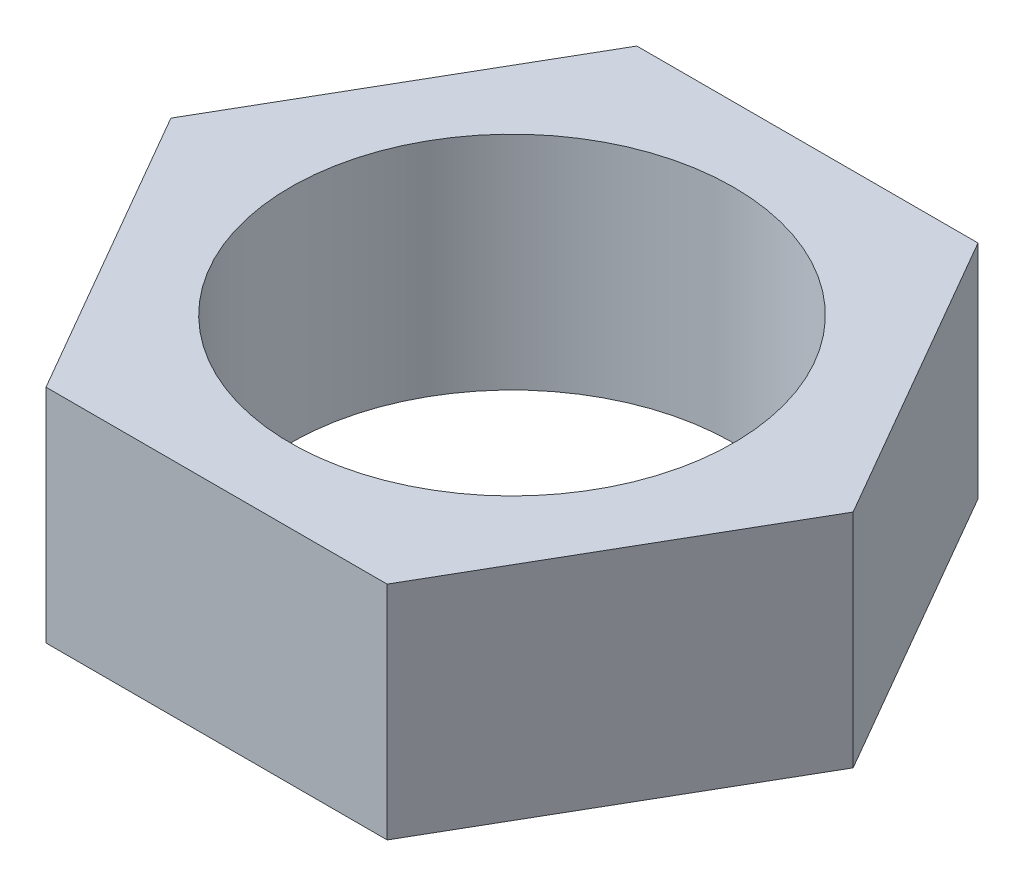
ISO-10303-21;
HEADER;
FILE_DESCRIPTION(('STEP AP214'),'2;1');
FILE_NAME('part.step','',(''),(''),'','','');
FILE_SCHEMA(('AUTOMOTIVE_DESIGN { 1 0 10303 214 1 1 1 1 }'));
ENDSEC;
DATA;
#1=APPLICATION_CONTEXT('core data for automotive mechanical design processes');
#2=APPLICATION_PROTOCOL_DEFINITION('international standard','automotive_design',2000,#1);
#3=PRODUCT_CONTEXT('',#1,'mechanical');
#4=PRODUCT('Part','Part','',(#3));
#5=PRODUCT_RELATED_PRODUCT_CATEGORY('part','',(#4));
#6=PRODUCT_DEFINITION_FORMATION('','',#4);
#7=PRODUCT_DEFINITION_CONTEXT('part definition',#1,'design');
#8=PRODUCT_DEFINITION('design','',#6,#7);
#9=PRODUCT_DEFINITION_SHAPE('','',#8);
#10=(LENGTH_UNIT() NAMED_UNIT(*) SI_UNIT(.MILLI.,.METRE.));
#11=(NAMED_UNIT(*) PLANE_ANGLE_UNIT() SI_UNIT($,.RADIAN.));
#12=(NAMED_UNIT(*) SI_UNIT($,.STERADIAN.) SOLID_ANGLE_UNIT());
#13=UNCERTAINTY_MEASURE_WITH_UNIT(LENGTH_MEASURE(1.E-05),#10,'distance_accuracy_value','');
#14=(GEOMETRIC_REPRESENTATION_CONTEXT(3) GLOBAL_UNCERTAINTY_ASSIGNED_CONTEXT((#13)) GLOBAL_UNIT_ASSIGNED_CONTEXT((#10,
#11,#12)) REPRESENTATION_CONTEXT('',''));
#15=CARTESIAN_POINT('',(0.,0.,0.));
#16=DIRECTION('',(0.,0.,1.));
#17=DIRECTION('',(1.,0.,0.));
#18=AXIS2_PLACEMENT_3D('',#15,#16,#17);
#19=CARTESIAN_POINT('',(2.30940107675854,3.,3.99999999999996));
#20=DIRECTION('',(-0.866025403784441,0.,-0.499999999999995));
#21=DIRECTION('',(-0.499999999999995,0.,0.866025403784442));
#22=AXIS2_PLACEMENT_3D('',#19,#20,#21);
#23=PLANE('',#22);
#24=DIRECTION('',(0.499999999999995,0.,-0.866025403784442));
#25=VECTOR('',#24,1.);
#26=CARTESIAN_POINT('',(2.30940107675854,0.,3.99999999999996));
#27=LINE('',#26,#25);
#28=CARTESIAN_POINT('',(2.30940107675854,0.,3.99999999999996));
#29=VERTEX_POINT('',#28);
#30=CARTESIAN_POINT('',(4.61880215351699,0.,0.));
#31=VERTEX_POINT('',#30);
#32=EDGE_CURVE('E128',#29,#31,#27,.T.);
#33=ORIENTED_EDGE('',*,*,#32,.T.);
#34=DIRECTION('',(0.,-1.,0.));
#35=VECTOR('',#34,1.);
#36=CARTESIAN_POINT('',(4.61880215351699,3.,0.));
#37=LINE('',#36,#35);
#38=CARTESIAN_POINT('',(4.61880215351699,3.,0.));
#39=VERTEX_POINT('',#38);
#40=EDGE_CURVE('E11',#39,#31,#37,.T.);
#41=ORIENTED_EDGE('',*,*,#40,.F.);
#42=DIRECTION('',(0.499999999999995,0.,-0.866025403784442));
#43=VECTOR('',#42,1.);
#44=CARTESIAN_POINT('',(2.30940107675854,3.,3.99999999999996));
#45=LINE('',#44,#43);
#46=CARTESIAN_POINT('',(2.30940107675854,3.,3.99999999999996));
#47=VERTEX_POINT('',#46);
#48=EDGE_CURVE('E145',#47,#39,#45,.T.);
#49=ORIENTED_EDGE('',*,*,#48,.F.);
#50=DIRECTION('',(0.,-1.,0.));
#51=VECTOR('',#50,1.);
#52=CARTESIAN_POINT('',(2.30940107675854,3.,3.99999999999996));
#53=LINE('',#52,#51);
#54=EDGE_CURVE('E124',#47,#29,#53,.T.);
#55=ORIENTED_EDGE('',*,*,#54,.T.);
#56=EDGE_LOOP('',(#33,#41,#49,#55));
#57=FACE_BOUND('',#56,.T.);
#58=ADVANCED_FACE('F39',(#57),#23,.F.);
#59=CARTESIAN_POINT('',(4.61880215351699,3.,0.));
#60=DIRECTION('',(-0.866025403784438,0.,0.500000000000001));
#61=DIRECTION('',(0.500000000000001,0.,0.866025403784438));
#62=AXIS2_PLACEMENT_3D('',#59,#60,#61);
#63=PLANE('',#62);
#64=DIRECTION('',(-0.500000000000001,0.,-0.866025403784438));
#65=VECTOR('',#64,1.);
#66=CARTESIAN_POINT('',(4.61880215351699,0.,0.));
#67=LINE('',#66,#65);
#68=CARTESIAN_POINT('',(2.30940107675849,0.,-3.99999999999999));
#69=VERTEX_POINT('',#68);
#70=EDGE_CURVE('E132',#31,#69,#67,.T.);
#71=ORIENTED_EDGE('',*,*,#70,.T.);
#72=DIRECTION('',(0.,-1.,0.));
#73=VECTOR('',#72,1.);
#74=CARTESIAN_POINT('',(2.30940107675849,3.,-3.99999999999999));
#75=LINE('',#74,#73);
#76=CARTESIAN_POINT('',(2.30940107675849,3.,-3.99999999999999));
#77=VERTEX_POINT('',#76);
#78=EDGE_CURVE('E48',#77,#69,#75,.T.);
#79=ORIENTED_EDGE('',*,*,#78,.F.);
#80=DIRECTION('',(-0.500000000000001,0.,-0.866025403784438));
#81=VECTOR('',#80,1.);
#82=CARTESIAN_POINT('',(4.61880215351699,3.,0.));
#83=LINE('',#82,#81);
#84=EDGE_CURVE('E93',#39,#77,#83,.T.);
#85=ORIENTED_EDGE('',*,*,#84,.F.);
#86=ORIENTED_EDGE('',*,*,#40,.T.);
#87=EDGE_LOOP('',(#71,#79,#85,#86));
#88=FACE_BOUND('',#87,.T.);
#89=ADVANCED_FACE('F174',(#88),#63,.F.);
#90=CARTESIAN_POINT('',(2.30940107675849,3.,-3.99999999999999));
#91=DIRECTION('',(0.,0.,1.));
#92=DIRECTION('',(1.,0.,0.));
#93=AXIS2_PLACEMENT_3D('',#90,#91,#92);
#94=PLANE('',#93);
#95=DIRECTION('',(-1.,0.,0.));
#96=VECTOR('',#95,1.);
#97=CARTESIAN_POINT('',(2.30940107675849,0.,-3.99999999999999));
#98=LINE('',#97,#96);
#99=CARTESIAN_POINT('',(-2.30940107675851,0.,-3.99999999999998));
#100=VERTEX_POINT('',#99);
#101=EDGE_CURVE('E136',#69,#100,#98,.T.);
#102=ORIENTED_EDGE('',*,*,#101,.T.);
#103=DIRECTION('',(0.,-1.,0.));
#104=VECTOR('',#103,1.);
#105=CARTESIAN_POINT('',(-2.30940107675851,3.,-3.99999999999998));
#106=LINE('',#105,#104);
#107=CARTESIAN_POINT('',(-2.30940107675851,3.,-3.99999999999998));
#108=VERTEX_POINT('',#107);
#109=EDGE_CURVE('E117',#108,#100,#106,.T.);
#110=ORIENTED_EDGE('',*,*,#109,.F.);
#111=DIRECTION('',(-1.,0.,0.));
#112=VECTOR('',#111,1.);
#113=CARTESIAN_POINT('',(2.30940107675849,3.,-3.99999999999999));
#114=LINE('',#113,#112);
#115=EDGE_CURVE('E106',#77,#108,#114,.T.);
#116=ORIENTED_EDGE('',*,*,#115,.F.);
#117=ORIENTED_EDGE('',*,*,#78,.T.);
#118=EDGE_LOOP('',(#102,#110,#116,#117));
#119=FACE_BOUND('',#118,.T.);
#120=ADVANCED_FACE('F155',(#119),#94,.F.);
#121=CARTESIAN_POINT('',(-2.30940107675851,3.,-3.99999999999998));
#122=DIRECTION('',(0.866025403784441,0.,0.499999999999995));
#123=DIRECTION('',(0.499999999999995,0.,-0.866025403784442));
#124=AXIS2_PLACEMENT_3D('',#121,#122,#123);
#125=PLANE('',#124);
#126=DIRECTION('',(-0.499999999999995,0.,0.866025403784442));
#127=VECTOR('',#126,1.);
#128=CARTESIAN_POINT('',(-2.30940107675851,0.,-3.99999999999998));
#129=LINE('',#128,#127);
#130=CARTESIAN_POINT('',(-4.61880215351699,0.,0.));
#131=VERTEX_POINT('',#130);
#132=EDGE_CURVE('E115',#100,#131,#129,.T.);
#133=ORIENTED_EDGE('',*,*,#132,.T.);
#134=DIRECTION('',(0.,-1.,0.));
#135=VECTOR('',#134,1.);
#136=CARTESIAN_POINT('',(-4.61880215351699,3.,0.));
#137=LINE('',#136,#135);
#138=CARTESIAN_POINT('',(-4.61880215351699,3.,0.));
#139=VERTEX_POINT('',#138);
#140=EDGE_CURVE('E112',#139,#131,#137,.T.);
#141=ORIENTED_EDGE('',*,*,#140,.F.);
#142=DIRECTION('',(-0.499999999999995,0.,0.866025403784442));
#143=VECTOR('',#142,1.);
#144=CARTESIAN_POINT('',(-2.30940107675851,3.,-3.99999999999998));
#145=LINE('',#144,#143);
#146=EDGE_CURVE('E100',#108,#139,#145,.T.);
#147=ORIENTED_EDGE('',*,*,#146,.F.);
#148=ORIENTED_EDGE('',*,*,#109,.T.);
#149=EDGE_LOOP('',(#133,#141,#147,#148));
#150=FACE_BOUND('',#149,.T.);
#151=ADVANCED_FACE('F113',(#150),#125,.F.);
#152=CARTESIAN_POINT('',(-4.61880215351699,3.,0.));
#153=DIRECTION('',(0.866025403784435,0.,-0.500000000000007));
#154=DIRECTION('',(-0.500000000000007,0.,-0.866025403784435));
#155=AXIS2_PLACEMENT_3D('',#152,#153,#154);
#156=PLANE('',#155);
#157=DIRECTION('',(0.500000000000007,0.,0.866025403784435));
#158=VECTOR('',#157,1.);
#159=CARTESIAN_POINT('',(-4.61880215351699,0.,0.));
#160=LINE('',#159,#158);
#161=CARTESIAN_POINT('',(-2.30940107675846,0.,4.00000000000001));
#162=VERTEX_POINT('',#161);
#163=EDGE_CURVE('E79',#131,#162,#160,.T.);
#164=ORIENTED_EDGE('',*,*,#163,.T.);
#165=DIRECTION('',(0.,-1.,0.));
#166=VECTOR('',#165,1.);
#167=CARTESIAN_POINT('',(-2.30940107675846,3.,4.00000000000001));
#168=LINE('',#167,#166);
#169=CARTESIAN_POINT('',(-2.30940107675846,3.,4.00000000000001));
#170=VERTEX_POINT('',#169);
#171=EDGE_CURVE('E118',#170,#162,#168,.T.);
#172=ORIENTED_EDGE('',*,*,#171,.F.);
#173=DIRECTION('',(0.500000000000007,0.,0.866025403784435));
#174=VECTOR('',#173,1.);
#175=CARTESIAN_POINT('',(-4.61880215351699,3.,0.));
#176=LINE('',#175,#174);
#177=EDGE_CURVE('E104',#139,#170,#176,.T.);
#178=ORIENTED_EDGE('',*,*,#177,.F.);
#179=ORIENTED_EDGE('',*,*,#140,.T.);
#180=EDGE_LOOP('',(#164,#172,#178,#179));
#181=FACE_BOUND('',#180,.T.);
#182=ADVANCED_FACE('F120',(#181),#156,.F.);
#183=CARTESIAN_POINT('',(-2.30940107675846,3.,4.00000000000001));
#184=DIRECTION('',(0.,0.,-1.));
#185=DIRECTION('',(-1.,0.,0.));
#186=AXIS2_PLACEMENT_3D('',#183,#184,#185);
#187=PLANE('',#186);
#188=DIRECTION('',(1.,0.,0.));
#189=VECTOR('',#188,1.);
#190=CARTESIAN_POINT('',(-2.30940107675846,0.,4.00000000000001));
#191=LINE('',#190,#189);
#192=EDGE_CURVE('E85',#162,#29,#191,.T.);
#193=ORIENTED_EDGE('',*,*,#192,.T.);
#194=ORIENTED_EDGE('',*,*,#54,.F.);
#195=DIRECTION('',(1.,0.,0.));
#196=VECTOR('',#195,1.);
#197=CARTESIAN_POINT('',(-2.30940107675846,3.,4.00000000000001));
#198=LINE('',#197,#196);
#199=EDGE_CURVE('E56',#170,#47,#198,.T.);
#200=ORIENTED_EDGE('',*,*,#199,.F.);
#201=ORIENTED_EDGE('',*,*,#171,.T.);
#202=EDGE_LOOP('',(#193,#194,#200,#201));
#203=FACE_BOUND('',#202,.T.);
#204=ADVANCED_FACE('F162',(#203),#187,.F.);
#205=CARTESIAN_POINT('',(0.,3.,0.));
#206=DIRECTION('',(0.,1.,0.));
#207=DIRECTION('',(0.,0.,1.));
#208=AXIS2_PLACEMENT_3D('',#205,#206,#207);
#209=PLANE('',#208);
#210=CARTESIAN_POINT('',(0.,3.,0.));
#211=DIRECTION('',(0.,-1.,0.));
#212=DIRECTION('',(0.,0.,-1.));
#213=AXIS2_PLACEMENT_3D('',#210,#211,#212);
#214=CIRCLE('',#213,3.);
#215=CARTESIAN_POINT('',(0.,3.,-3.));
#216=VERTEX_POINT('',#215);
#217=EDGE_CURVE('E133',#216,#216,#214,.T.);
#218=ORIENTED_EDGE('',*,*,#217,.T.);
#219=EDGE_LOOP('',(#218));
#220=FACE_BOUND('',#219,.T.);
#221=ORIENTED_EDGE('',*,*,#48,.T.);
#222=ORIENTED_EDGE('',*,*,#84,.T.);
#223=ORIENTED_EDGE('',*,*,#115,.T.);
#224=ORIENTED_EDGE('',*,*,#146,.T.);
#225=ORIENTED_EDGE('',*,*,#177,.T.);
#226=ORIENTED_EDGE('',*,*,#199,.T.);
#227=EDGE_LOOP('',(#221,#222,#223,#224,#225,#226));
#228=FACE_BOUND('',#227,.T.);
#229=ADVANCED_FACE('F102',(#220,#228),#209,.T.);
#230=CARTESIAN_POINT('',(0.,0.,0.));
#231=DIRECTION('',(0.,1.,0.));
#232=DIRECTION('',(0.,0.,1.));
#233=AXIS2_PLACEMENT_3D('',#230,#231,#232);
#234=PLANE('',#233);
#235=CARTESIAN_POINT('',(0.,0.,0.));
#236=DIRECTION('',(0.,-1.,0.));
#237=DIRECTION('',(0.,0.,-1.));
#238=AXIS2_PLACEMENT_3D('',#235,#236,#237);
#239=CIRCLE('',#238,3.);
#240=CARTESIAN_POINT('',(0.,0.,-3.));
#241=VERTEX_POINT('',#240);
#242=EDGE_CURVE('E229',#241,#241,#239,.T.);
#243=ORIENTED_EDGE('',*,*,#242,.F.);
#244=EDGE_LOOP('',(#243));
#245=FACE_BOUND('',#244,.T.);
#246=ORIENTED_EDGE('',*,*,#32,.F.);
#247=ORIENTED_EDGE('',*,*,#192,.F.);
#248=ORIENTED_EDGE('',*,*,#163,.F.);
#249=ORIENTED_EDGE('',*,*,#132,.F.);
#250=ORIENTED_EDGE('',*,*,#101,.F.);
#251=ORIENTED_EDGE('',*,*,#70,.F.);
#252=EDGE_LOOP('',(#246,#247,#248,#249,#250,#251));
#253=FACE_BOUND('',#252,.T.);
#254=ADVANCED_FACE('F158',(#245,#253),#234,.F.);
#255=CARTESIAN_POINT('',(0.,3.,0.));
#256=DIRECTION('',(0.,-1.,0.));
#257=DIRECTION('',(0.,0.,-1.));
#258=AXIS2_PLACEMENT_3D('',#255,#256,#257);
#259=CYLINDRICAL_SURFACE('',#258,3.);
#260=ORIENTED_EDGE('',*,*,#217,.F.);
#261=EDGE_LOOP('',(#260));
#262=FACE_BOUND('',#261,.T.);
#263=ORIENTED_EDGE('',*,*,#242,.T.);
#264=EDGE_LOOP('',(#263));
#265=FACE_BOUND('',#264,.T.);
#266=ADVANCED_FACE('F211',(#262,#265),#259,.F.);
#267=CLOSED_SHELL('',(#58,#89,#120,#151,#182,#204,#229,#254,#266));
#268=MANIFOLD_SOLID_BREP('B2',#267);
#269=ADVANCED_BREP_SHAPE_REPRESENTATION('',(#18,#268),#14);
#270=SHAPE_DEFINITION_REPRESENTATION(#9,#269);
ENDSEC;
END-ISO-10303-21;
